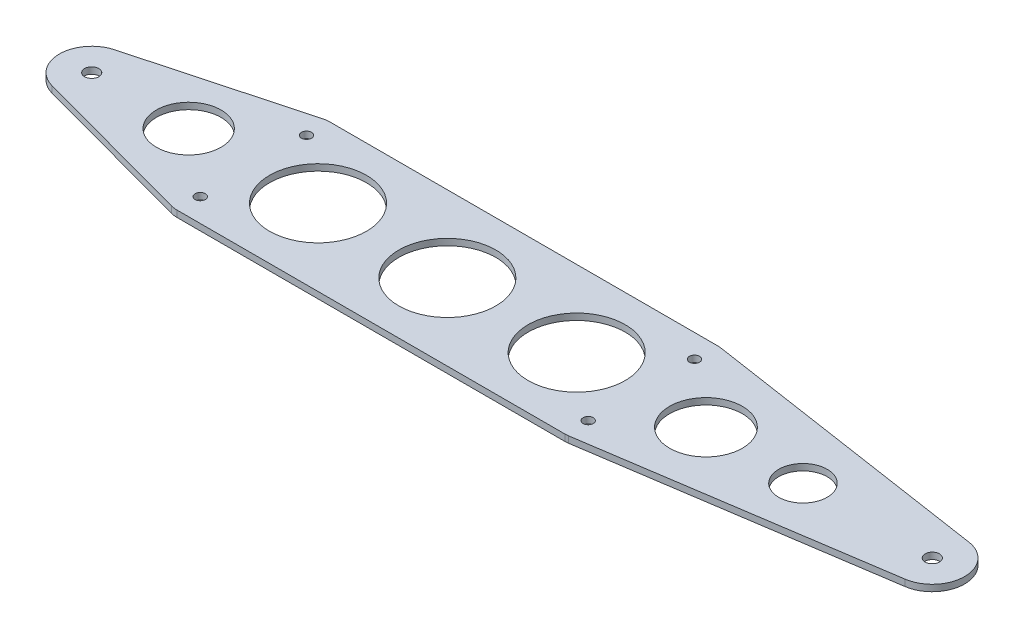
ISO-10303-21;
HEADER;
FILE_DESCRIPTION(('STEP AP214'),'2;1');
FILE_NAME('part.step','',(''),(''),'','','');
FILE_SCHEMA(('AUTOMOTIVE_DESIGN { 1 0 10303 214 1 1 1 1 }'));
ENDSEC;
DATA;
#1=APPLICATION_CONTEXT('core data for automotive mechanical design processes');
#2=APPLICATION_PROTOCOL_DEFINITION('international standard','automotive_design',2000,#1);
#3=PRODUCT_CONTEXT('',#1,'mechanical');
#4=PRODUCT('Part','Part','',(#3));
#5=PRODUCT_RELATED_PRODUCT_CATEGORY('part','',(#4));
#6=PRODUCT_DEFINITION_FORMATION('','',#4);
#7=PRODUCT_DEFINITION_CONTEXT('part definition',#1,'design');
#8=PRODUCT_DEFINITION('design','',#6,#7);
#9=PRODUCT_DEFINITION_SHAPE('','',#8);
#10=(LENGTH_UNIT() NAMED_UNIT(*) SI_UNIT(.MILLI.,.METRE.));
#11=(NAMED_UNIT(*) PLANE_ANGLE_UNIT() SI_UNIT($,.RADIAN.));
#12=(NAMED_UNIT(*) SI_UNIT($,.STERADIAN.) SOLID_ANGLE_UNIT());
#13=UNCERTAINTY_MEASURE_WITH_UNIT(LENGTH_MEASURE(1.E-05),#10,'distance_accuracy_value','');
#14=(GEOMETRIC_REPRESENTATION_CONTEXT(3) GLOBAL_UNCERTAINTY_ASSIGNED_CONTEXT((#13)) GLOBAL_UNIT_ASSIGNED_CONTEXT((#10,
#11,#12)) REPRESENTATION_CONTEXT('',''));
#15=CARTESIAN_POINT('',(0.,0.,0.));
#16=DIRECTION('',(0.,0.,1.));
#17=DIRECTION('',(1.,0.,0.));
#18=AXIS2_PLACEMENT_3D('',#15,#16,#17);
#19=CARTESIAN_POINT('',(-177.8,-2.54,-30.));
#20=DIRECTION('',(0.,0.,-1.));
#21=DIRECTION('',(-1.,0.,0.));
#22=AXIS2_PLACEMENT_3D('',#19,#20,#21);
#23=PLANE('',#22);
#24=DIRECTION('',(-1.,0.,0.));
#25=VECTOR('',#24,1.);
#26=CARTESIAN_POINT('',(-177.8,-2.54,-30.));
#27=LINE('',#26,#25);
#28=CARTESIAN_POINT('',(50.8,-2.54,-30.));
#29=VERTEX_POINT('',#28);
#30=CARTESIAN_POINT('',(-101.6,-2.54,-30.));
#31=VERTEX_POINT('',#30);
#32=EDGE_CURVE('E162',#29,#31,#27,.T.);
#33=ORIENTED_EDGE('',*,*,#32,.T.);
#34=DIRECTION('',(0.,1.,0.));
#35=VECTOR('',#34,1.);
#36=CARTESIAN_POINT('',(-101.6,-2.54,-30.));
#37=LINE('',#36,#35);
#38=CARTESIAN_POINT('',(-101.6,0.,-30.));
#39=VERTEX_POINT('',#38);
#40=EDGE_CURVE('E440',#31,#39,#37,.T.);
#41=ORIENTED_EDGE('',*,*,#40,.T.);
#42=DIRECTION('',(-1.,0.,0.));
#43=VECTOR('',#42,1.);
#44=CARTESIAN_POINT('',(-177.8,0.,-30.));
#45=LINE('',#44,#43);
#46=CARTESIAN_POINT('',(50.8,0.,-30.));
#47=VERTEX_POINT('',#46);
#48=EDGE_CURVE('E163',#47,#39,#45,.T.);
#49=ORIENTED_EDGE('',*,*,#48,.F.);
#50=DIRECTION('',(0.,1.,0.));
#51=VECTOR('',#50,1.);
#52=CARTESIAN_POINT('',(50.8,-2.54,-30.));
#53=LINE('',#52,#51);
#54=EDGE_CURVE('E443',#29,#47,#53,.T.);
#55=ORIENTED_EDGE('',*,*,#54,.F.);
#56=EDGE_LOOP('',(#33,#41,#49,#55));
#57=FACE_BOUND('',#56,.T.);
#58=ADVANCED_FACE('F44',(#57),#23,.T.);
#59=CARTESIAN_POINT('',(-177.8,-2.54,30.));
#60=DIRECTION('',(0.,0.,1.));
#61=DIRECTION('',(1.,0.,0.));
#62=AXIS2_PLACEMENT_3D('',#59,#60,#61);
#63=PLANE('',#62);
#64=DIRECTION('',(0.,1.,0.));
#65=VECTOR('',#64,1.);
#66=CARTESIAN_POINT('',(-101.6,-2.54,30.));
#67=LINE('',#66,#65);
#68=CARTESIAN_POINT('',(-101.6,-2.54,30.));
#69=VERTEX_POINT('',#68);
#70=CARTESIAN_POINT('',(-101.6,0.,30.));
#71=VERTEX_POINT('',#70);
#72=EDGE_CURVE('E138',#69,#71,#67,.T.);
#73=ORIENTED_EDGE('',*,*,#72,.F.);
#74=DIRECTION('',(1.,0.,0.));
#75=VECTOR('',#74,1.);
#76=CARTESIAN_POINT('',(-177.8,-2.54,30.));
#77=LINE('',#76,#75);
#78=CARTESIAN_POINT('',(50.8,-2.54,30.));
#79=VERTEX_POINT('',#78);
#80=EDGE_CURVE('E152',#69,#79,#77,.T.);
#81=ORIENTED_EDGE('',*,*,#80,.T.);
#82=DIRECTION('',(0.,1.,0.));
#83=VECTOR('',#82,1.);
#84=CARTESIAN_POINT('',(50.8,-2.54,30.));
#85=LINE('',#84,#83);
#86=CARTESIAN_POINT('',(50.8,0.,30.));
#87=VERTEX_POINT('',#86);
#88=EDGE_CURVE('E155',#79,#87,#85,.T.);
#89=ORIENTED_EDGE('',*,*,#88,.T.);
#90=DIRECTION('',(1.,0.,0.));
#91=VECTOR('',#90,1.);
#92=CARTESIAN_POINT('',(-177.8,0.,30.));
#93=LINE('',#92,#91);
#94=EDGE_CURVE('E154',#71,#87,#93,.T.);
#95=ORIENTED_EDGE('',*,*,#94,.F.);
#96=EDGE_LOOP('',(#73,#81,#89,#95));
#97=FACE_BOUND('',#96,.T.);
#98=ADVANCED_FACE('F46',(#97),#63,.T.);
#99=CARTESIAN_POINT('',(0.,-2.54,0.));
#100=DIRECTION('',(0.,1.,0.));
#101=DIRECTION('',(0.,0.,1.));
#102=AXIS2_PLACEMENT_3D('',#99,#100,#101);
#103=PLANE('',#102);
#104=CARTESIAN_POINT('',(-127.,-2.54,0.));
#105=DIRECTION('',(0.,1.,0.));
#106=DIRECTION('',(0.,0.,1.));
#107=AXIS2_PLACEMENT_3D('',#104,#105,#106);
#108=CIRCLE('',#107,12.7);
#109=CARTESIAN_POINT('',(-127.,-2.54,12.7));
#110=VERTEX_POINT('',#109);
#111=EDGE_CURVE('E263',#110,#110,#108,.T.);
#112=ORIENTED_EDGE('',*,*,#111,.T.);
#113=EDGE_LOOP('',(#112));
#114=FACE_BOUND('',#113,.T.);
#115=CARTESIAN_POINT('',(76.2,-2.54,0.));
#116=DIRECTION('',(0.,1.,0.));
#117=DIRECTION('',(0.,0.,1.));
#118=AXIS2_PLACEMENT_3D('',#115,#116,#117);
#119=CIRCLE('',#118,14.2875);
#120=CARTESIAN_POINT('',(76.2,-2.54,14.2875));
#121=VERTEX_POINT('',#120);
#122=EDGE_CURVE('E267',#121,#121,#119,.T.);
#123=ORIENTED_EDGE('',*,*,#122,.T.);
#124=EDGE_LOOP('',(#123));
#125=FACE_BOUND('',#124,.T.);
#126=CARTESIAN_POINT('',(114.3,-2.54,0.));
#127=DIRECTION('',(0.,1.,0.));
#128=DIRECTION('',(0.,0.,1.));
#129=AXIS2_PLACEMENT_3D('',#126,#127,#128);
#130=CIRCLE('',#129,9.52500000000001);
#131=CARTESIAN_POINT('',(114.3,-2.54,9.52500000000001));
#132=VERTEX_POINT('',#131);
#133=EDGE_CURVE('E271',#132,#132,#130,.T.);
#134=ORIENTED_EDGE('',*,*,#133,.T.);
#135=EDGE_LOOP('',(#134));
#136=FACE_BOUND('',#135,.T.);
#137=CARTESIAN_POINT('',(25.4,-2.54,0.));
#138=DIRECTION('',(0.,1.,0.));
#139=DIRECTION('',(0.,0.,1.));
#140=AXIS2_PLACEMENT_3D('',#137,#138,#139);
#141=CIRCLE('',#140,19.05);
#142=CARTESIAN_POINT('',(25.4,-2.54,19.05));
#143=VERTEX_POINT('',#142);
#144=EDGE_CURVE('E275',#143,#143,#141,.T.);
#145=ORIENTED_EDGE('',*,*,#144,.T.);
#146=EDGE_LOOP('',(#145));
#147=FACE_BOUND('',#146,.T.);
#148=CARTESIAN_POINT('',(-76.2,-2.54,0.));
#149=DIRECTION('',(0.,1.,0.));
#150=DIRECTION('',(0.,0.,1.));
#151=AXIS2_PLACEMENT_3D('',#148,#149,#150);
#152=CIRCLE('',#151,19.05);
#153=CARTESIAN_POINT('',(-76.2,-2.54,19.05));
#154=VERTEX_POINT('',#153);
#155=EDGE_CURVE('E279',#154,#154,#152,.T.);
#156=ORIENTED_EDGE('',*,*,#155,.T.);
#157=EDGE_LOOP('',(#156));
#158=FACE_BOUND('',#157,.T.);
#159=CARTESIAN_POINT('',(-25.4,-2.54,0.));
#160=DIRECTION('',(0.,1.,0.));
#161=DIRECTION('',(0.,0.,1.));
#162=AXIS2_PLACEMENT_3D('',#159,#160,#161);
#163=CIRCLE('',#162,19.05);
#164=CARTESIAN_POINT('',(-25.4,-2.54,19.05));
#165=VERTEX_POINT('',#164);
#166=EDGE_CURVE('E283',#165,#165,#163,.T.);
#167=ORIENTED_EDGE('',*,*,#166,.T.);
#168=EDGE_LOOP('',(#167));
#169=FACE_BOUND('',#168,.T.);
#170=CARTESIAN_POINT('',(-101.6,-2.54,20.875));
#171=DIRECTION('',(0.,1.,0.));
#172=DIRECTION('',(0.,0.,1.));
#173=AXIS2_PLACEMENT_3D('',#170,#171,#172);
#174=CIRCLE('',#173,2.);
#175=CARTESIAN_POINT('',(-101.6,-2.54,22.875));
#176=VERTEX_POINT('',#175);
#177=EDGE_CURVE('E213',#176,#176,#174,.T.);
#178=ORIENTED_EDGE('',*,*,#177,.T.);
#179=EDGE_LOOP('',(#178));
#180=FACE_BOUND('',#179,.T.);
#181=CARTESIAN_POINT('',(50.8,-2.54,-20.875));
#182=DIRECTION('',(0.,1.,0.));
#183=DIRECTION('',(0.,0.,1.));
#184=AXIS2_PLACEMENT_3D('',#181,#182,#183);
#185=CIRCLE('',#184,2.);
#186=CARTESIAN_POINT('',(50.8,-2.54,-18.875));
#187=VERTEX_POINT('',#186);
#188=EDGE_CURVE('E220',#187,#187,#185,.T.);
#189=ORIENTED_EDGE('',*,*,#188,.T.);
#190=EDGE_LOOP('',(#189));
#191=FACE_BOUND('',#190,.T.);
#192=CARTESIAN_POINT('',(50.8,-2.54,20.875));
#193=DIRECTION('',(0.,1.,0.));
#194=DIRECTION('',(0.,0.,1.));
#195=AXIS2_PLACEMENT_3D('',#192,#193,#194);
#196=CIRCLE('',#195,2.);
#197=CARTESIAN_POINT('',(50.8,-2.54,22.875));
#198=VERTEX_POINT('',#197);
#199=EDGE_CURVE('E206',#198,#198,#196,.T.);
#200=ORIENTED_EDGE('',*,*,#199,.T.);
#201=EDGE_LOOP('',(#200));
#202=FACE_BOUND('',#201,.T.);
#203=CARTESIAN_POINT('',(-101.6,-2.54,-20.875));
#204=DIRECTION('',(0.,1.,0.));
#205=DIRECTION('',(0.,0.,1.));
#206=AXIS2_PLACEMENT_3D('',#203,#204,#205);
#207=CIRCLE('',#206,2.);
#208=CARTESIAN_POINT('',(-101.6,-2.54,-18.875));
#209=VERTEX_POINT('',#208);
#210=EDGE_CURVE('E225',#209,#209,#207,.T.);
#211=ORIENTED_EDGE('',*,*,#210,.T.);
#212=EDGE_LOOP('',(#211));
#213=FACE_BOUND('',#212,.T.);
#214=CARTESIAN_POINT('',(-165.1,-2.54,0.));
#215=DIRECTION('',(0.,1.,0.));
#216=DIRECTION('',(0.,0.,1.));
#217=AXIS2_PLACEMENT_3D('',#214,#215,#216);
#218=CIRCLE('',#217,2.80000000000001);
#219=CARTESIAN_POINT('',(-165.1,-2.54,2.80000000000001));
#220=VERTEX_POINT('',#219);
#221=EDGE_CURVE('E178',#220,#220,#218,.T.);
#222=ORIENTED_EDGE('',*,*,#221,.T.);
#223=EDGE_LOOP('',(#222));
#224=FACE_BOUND('',#223,.T.);
#225=CARTESIAN_POINT('',(165.1,-2.54,0.));
#226=DIRECTION('',(0.,1.,0.));
#227=DIRECTION('',(0.,0.,1.));
#228=AXIS2_PLACEMENT_3D('',#225,#226,#227);
#229=CIRCLE('',#228,2.80000000000001);
#230=CARTESIAN_POINT('',(165.1,-2.54,2.80000000000001));
#231=VERTEX_POINT('',#230);
#232=EDGE_CURVE('E170',#231,#231,#229,.T.);
#233=ORIENTED_EDGE('',*,*,#232,.T.);
#234=EDGE_LOOP('',(#233));
#235=FACE_BOUND('',#234,.T.);
#236=CARTESIAN_POINT('',(-101.6,-2.54,20.875));
#237=DIRECTION('',(0.,1.,0.));
#238=DIRECTION('',(0.,0.,1.));
#239=AXIS2_PLACEMENT_3D('',#236,#237,#238);
#240=CIRCLE('',#239,9.12500000000001);
#241=CARTESIAN_POINT('',(-103.982013976738,-2.54,29.6836113783403));
#242=VERTEX_POINT('',#241);
#243=EDGE_CURVE('E134',#242,#69,#240,.T.);
#244=ORIENTED_EDGE('',*,*,#243,.F.);
#245=DIRECTION('',(0.965327274338659,0.,0.261042627587709));
#246=VECTOR('',#245,1.);
#247=CARTESIAN_POINT('',(-168.415241370364,-2.54,12.259656384101));
#248=LINE('',#247,#246);
#249=CARTESIAN_POINT('',(-168.415241370364,-2.54,12.259656384101));
#250=VERTEX_POINT('',#249);
#251=EDGE_CURVE('E156',#250,#242,#248,.T.);
#252=ORIENTED_EDGE('',*,*,#251,.F.);
#253=CARTESIAN_POINT('',(-165.1,-2.54,0.));
#254=DIRECTION('',(0.,1.,0.));
#255=DIRECTION('',(0.,0.,1.));
#256=AXIS2_PLACEMENT_3D('',#253,#254,#255);
#257=CIRCLE('',#256,12.7);
#258=CARTESIAN_POINT('',(-168.415240859482,-2.54,-12.2596565222531));
#259=VERTEX_POINT('',#258);
#260=EDGE_CURVE('E418',#259,#250,#257,.T.);
#261=ORIENTED_EDGE('',*,*,#260,.F.);
#262=DIRECTION('',(-0.965327274338659,0.,0.261042627587709));
#263=VECTOR('',#262,1.);
#264=CARTESIAN_POINT('',(-168.415240859482,-2.54,-12.2596565222531));
#265=LINE('',#264,#263);
#266=CARTESIAN_POINT('',(-103.982013976738,-2.54,-29.6836113783403));
#267=VERTEX_POINT('',#266);
#268=EDGE_CURVE('E415',#267,#259,#265,.T.);
#269=ORIENTED_EDGE('',*,*,#268,.F.);
#270=CARTESIAN_POINT('',(-101.6,-2.54,-20.875));
#271=DIRECTION('',(0.,1.,0.));
#272=DIRECTION('',(0.,0.,1.));
#273=AXIS2_PLACEMENT_3D('',#270,#271,#272);
#274=CIRCLE('',#273,9.12500000000001);
#275=EDGE_CURVE('E412',#31,#267,#274,.T.);
#276=ORIENTED_EDGE('',*,*,#275,.F.);
#277=ORIENTED_EDGE('',*,*,#32,.F.);
#278=CARTESIAN_POINT('',(50.8,-2.54,-20.875));
#279=DIRECTION('',(0.,1.,0.));
#280=DIRECTION('',(0.,0.,1.));
#281=AXIS2_PLACEMENT_3D('',#278,#279,#280);
#282=CIRCLE('',#281,9.12499999999998);
#283=CARTESIAN_POINT('',(52.16244344239,-2.54,-29.8977142737808));
#284=VERTEX_POINT('',#283);
#285=EDGE_CURVE('E410',#284,#29,#282,.T.);
#286=ORIENTED_EDGE('',*,*,#285,.F.);
#287=DIRECTION('',(-0.988790605345846,0.,-0.149308870398902));
#288=VECTOR('',#287,1.);
#289=CARTESIAN_POINT('',(52.16244344239,-2.54,-29.8977142737808));
#290=LINE('',#289,#288);
#291=CARTESIAN_POINT('',(166.996222654066,-2.54,-12.5576406878922));
#292=VERTEX_POINT('',#291);
#293=EDGE_CURVE('E407',#292,#284,#290,.T.);
#294=ORIENTED_EDGE('',*,*,#293,.F.);
#295=CARTESIAN_POINT('',(165.1,-2.54,0.));
#296=DIRECTION('',(0.,1.,0.));
#297=DIRECTION('',(0.,0.,1.));
#298=AXIS2_PLACEMENT_3D('',#295,#296,#297);
#299=CIRCLE('',#298,12.7);
#300=CARTESIAN_POINT('',(166.996222654066,-2.54,12.5576406878922));
#301=VERTEX_POINT('',#300);
#302=EDGE_CURVE('E405',#301,#292,#299,.T.);
#303=ORIENTED_EDGE('',*,*,#302,.F.);
#304=DIRECTION('',(0.988790605345845,0.,-0.149308870398902));
#305=VECTOR('',#304,1.);
#306=CARTESIAN_POINT('',(52.16244344239,-2.54,29.8977142737808));
#307=LINE('',#306,#305);
#308=CARTESIAN_POINT('',(52.16244344239,-2.54,29.8977142737808));
#309=VERTEX_POINT('',#308);
#310=EDGE_CURVE('E197',#309,#301,#307,.T.);
#311=ORIENTED_EDGE('',*,*,#310,.F.);
#312=CARTESIAN_POINT('',(50.8,-2.54,20.875));
#313=DIRECTION('',(0.,1.,0.));
#314=DIRECTION('',(0.,0.,1.));
#315=AXIS2_PLACEMENT_3D('',#312,#313,#314);
#316=CIRCLE('',#315,9.125);
#317=EDGE_CURVE('E145',#79,#309,#316,.T.);
#318=ORIENTED_EDGE('',*,*,#317,.F.);
#319=ORIENTED_EDGE('',*,*,#80,.F.);
#320=EDGE_LOOP('',(#244,#252,#261,#269,#276,#277,#286,#294,#303,#311,#318,#319));
#321=FACE_BOUND('',#320,.T.);
#322=ADVANCED_FACE('F159',(#114,#125,#136,#147,#158,#169,#180,#191,#202,#213,#224,#235,#321),
#103,.F.);
#323=CARTESIAN_POINT('',(0.,0.,0.));
#324=DIRECTION('',(0.,1.,0.));
#325=DIRECTION('',(0.,0.,1.));
#326=AXIS2_PLACEMENT_3D('',#323,#324,#325);
#327=PLANE('',#326);
#328=CARTESIAN_POINT('',(-127.,0.,0.));
#329=DIRECTION('',(0.,1.,0.));
#330=DIRECTION('',(0.,0.,1.));
#331=AXIS2_PLACEMENT_3D('',#328,#329,#330);
#332=CIRCLE('',#331,12.7);
#333=CARTESIAN_POINT('',(-127.,0.,12.7));
#334=VERTEX_POINT('',#333);
#335=EDGE_CURVE('E378',#334,#334,#332,.T.);
#336=ORIENTED_EDGE('',*,*,#335,.F.);
#337=EDGE_LOOP('',(#336));
#338=FACE_BOUND('',#337,.T.);
#339=CARTESIAN_POINT('',(76.2,0.,0.));
#340=DIRECTION('',(0.,1.,0.));
#341=DIRECTION('',(0.,0.,1.));
#342=AXIS2_PLACEMENT_3D('',#339,#340,#341);
#343=CIRCLE('',#342,14.2875);
#344=CARTESIAN_POINT('',(76.2,0.,14.2875));
#345=VERTEX_POINT('',#344);
#346=EDGE_CURVE('E381',#345,#345,#343,.T.);
#347=ORIENTED_EDGE('',*,*,#346,.F.);
#348=EDGE_LOOP('',(#347));
#349=FACE_BOUND('',#348,.T.);
#350=CARTESIAN_POINT('',(114.3,0.,0.));
#351=DIRECTION('',(0.,1.,0.));
#352=DIRECTION('',(0.,0.,1.));
#353=AXIS2_PLACEMENT_3D('',#350,#351,#352);
#354=CIRCLE('',#353,9.52500000000001);
#355=CARTESIAN_POINT('',(114.3,0.,9.52500000000001));
#356=VERTEX_POINT('',#355);
#357=EDGE_CURVE('E387',#356,#356,#354,.T.);
#358=ORIENTED_EDGE('',*,*,#357,.F.);
#359=EDGE_LOOP('',(#358));
#360=FACE_BOUND('',#359,.T.);
#361=CARTESIAN_POINT('',(25.4,0.,0.));
#362=DIRECTION('',(0.,1.,0.));
#363=DIRECTION('',(0.,0.,1.));
#364=AXIS2_PLACEMENT_3D('',#361,#362,#363);
#365=CIRCLE('',#364,19.05);
#366=CARTESIAN_POINT('',(25.4,0.,19.05));
#367=VERTEX_POINT('',#366);
#368=EDGE_CURVE('E391',#367,#367,#365,.T.);
#369=ORIENTED_EDGE('',*,*,#368,.F.);
#370=EDGE_LOOP('',(#369));
#371=FACE_BOUND('',#370,.T.);
#372=CARTESIAN_POINT('',(-76.2,0.,0.));
#373=DIRECTION('',(0.,1.,0.));
#374=DIRECTION('',(0.,0.,1.));
#375=AXIS2_PLACEMENT_3D('',#372,#373,#374);
#376=CIRCLE('',#375,19.05);
#377=CARTESIAN_POINT('',(-76.2,0.,19.05));
#378=VERTEX_POINT('',#377);
#379=EDGE_CURVE('E392',#378,#378,#376,.T.);
#380=ORIENTED_EDGE('',*,*,#379,.F.);
#381=EDGE_LOOP('',(#380));
#382=FACE_BOUND('',#381,.T.);
#383=CARTESIAN_POINT('',(-25.4,0.,0.));
#384=DIRECTION('',(0.,1.,0.));
#385=DIRECTION('',(0.,0.,1.));
#386=AXIS2_PLACEMENT_3D('',#383,#384,#385);
#387=CIRCLE('',#386,19.05);
#388=CARTESIAN_POINT('',(-25.4,0.,19.05));
#389=VERTEX_POINT('',#388);
#390=EDGE_CURVE('E395',#389,#389,#387,.T.);
#391=ORIENTED_EDGE('',*,*,#390,.F.);
#392=EDGE_LOOP('',(#391));
#393=FACE_BOUND('',#392,.T.);
#394=CARTESIAN_POINT('',(-101.6,0.,20.875));
#395=DIRECTION('',(0.,1.,0.));
#396=DIRECTION('',(0.,0.,1.));
#397=AXIS2_PLACEMENT_3D('',#394,#395,#396);
#398=CIRCLE('',#397,2.);
#399=CARTESIAN_POINT('',(-101.6,0.,22.875));
#400=VERTEX_POINT('',#399);
#401=EDGE_CURVE('E217',#400,#400,#398,.T.);
#402=ORIENTED_EDGE('',*,*,#401,.F.);
#403=EDGE_LOOP('',(#402));
#404=FACE_BOUND('',#403,.T.);
#405=CARTESIAN_POINT('',(50.8,0.,-20.875));
#406=DIRECTION('',(0.,1.,0.));
#407=DIRECTION('',(0.,0.,1.));
#408=AXIS2_PLACEMENT_3D('',#405,#406,#407);
#409=CIRCLE('',#408,2.);
#410=CARTESIAN_POINT('',(50.8,0.,-18.875));
#411=VERTEX_POINT('',#410);
#412=EDGE_CURVE('E209',#411,#411,#409,.T.);
#413=ORIENTED_EDGE('',*,*,#412,.F.);
#414=EDGE_LOOP('',(#413));
#415=FACE_BOUND('',#414,.T.);
#416=CARTESIAN_POINT('',(50.8,0.,20.875));
#417=DIRECTION('',(0.,1.,0.));
#418=DIRECTION('',(0.,0.,1.));
#419=AXIS2_PLACEMENT_3D('',#416,#417,#418);
#420=CIRCLE('',#419,2.);
#421=CARTESIAN_POINT('',(50.8,0.,22.875));
#422=VERTEX_POINT('',#421);
#423=EDGE_CURVE('E210',#422,#422,#420,.T.);
#424=ORIENTED_EDGE('',*,*,#423,.F.);
#425=EDGE_LOOP('',(#424));
#426=FACE_BOUND('',#425,.T.);
#427=CARTESIAN_POINT('',(-101.6,0.,-20.875));
#428=DIRECTION('',(0.,1.,0.));
#429=DIRECTION('',(0.,0.,1.));
#430=AXIS2_PLACEMENT_3D('',#427,#428,#429);
#431=CIRCLE('',#430,2.);
#432=CARTESIAN_POINT('',(-101.6,0.,-18.875));
#433=VERTEX_POINT('',#432);
#434=EDGE_CURVE('E216',#433,#433,#431,.T.);
#435=ORIENTED_EDGE('',*,*,#434,.F.);
#436=EDGE_LOOP('',(#435));
#437=FACE_BOUND('',#436,.T.);
#438=CARTESIAN_POINT('',(-165.1,0.,0.));
#439=DIRECTION('',(0.,1.,0.));
#440=DIRECTION('',(0.,0.,1.));
#441=AXIS2_PLACEMENT_3D('',#438,#439,#440);
#442=CIRCLE('',#441,2.80000000000001);
#443=CARTESIAN_POINT('',(-165.1,0.,2.80000000000001));
#444=VERTEX_POINT('',#443);
#445=EDGE_CURVE('E173',#444,#444,#442,.T.);
#446=ORIENTED_EDGE('',*,*,#445,.F.);
#447=EDGE_LOOP('',(#446));
#448=FACE_BOUND('',#447,.T.);
#449=CARTESIAN_POINT('',(165.1,0.,0.));
#450=DIRECTION('',(0.,1.,0.));
#451=DIRECTION('',(0.,0.,1.));
#452=AXIS2_PLACEMENT_3D('',#449,#450,#451);
#453=CIRCLE('',#452,2.80000000000001);
#454=CARTESIAN_POINT('',(165.1,0.,2.80000000000001));
#455=VERTEX_POINT('',#454);
#456=EDGE_CURVE('E175',#455,#455,#453,.T.);
#457=ORIENTED_EDGE('',*,*,#456,.F.);
#458=EDGE_LOOP('',(#457));
#459=FACE_BOUND('',#458,.T.);
#460=DIRECTION('',(0.965327274338659,0.,0.261042627587709));
#461=VECTOR('',#460,1.);
#462=CARTESIAN_POINT('',(-168.415241370364,0.,12.259656384101));
#463=LINE('',#462,#461);
#464=CARTESIAN_POINT('',(-168.415241370364,0.,12.259656384101));
#465=VERTEX_POINT('',#464);
#466=CARTESIAN_POINT('',(-103.982013976738,0.,29.6836113783403));
#467=VERTEX_POINT('',#466);
#468=EDGE_CURVE('E146',#465,#467,#463,.T.);
#469=ORIENTED_EDGE('',*,*,#468,.T.);
#470=CARTESIAN_POINT('',(-101.6,0.,20.875));
#471=DIRECTION('',(0.,1.,0.));
#472=DIRECTION('',(0.,0.,1.));
#473=AXIS2_PLACEMENT_3D('',#470,#471,#472);
#474=CIRCLE('',#473,9.12500000000001);
#475=EDGE_CURVE('E400',#467,#71,#474,.T.);
#476=ORIENTED_EDGE('',*,*,#475,.T.);
#477=ORIENTED_EDGE('',*,*,#94,.T.);
#478=CARTESIAN_POINT('',(50.8,0.,20.875));
#479=DIRECTION('',(0.,1.,0.));
#480=DIRECTION('',(0.,0.,1.));
#481=AXIS2_PLACEMENT_3D('',#478,#479,#480);
#482=CIRCLE('',#481,9.125);
#483=CARTESIAN_POINT('',(52.16244344239,0.,29.8977142737808));
#484=VERTEX_POINT('',#483);
#485=EDGE_CURVE('E422',#87,#484,#482,.T.);
#486=ORIENTED_EDGE('',*,*,#485,.T.);
#487=DIRECTION('',(0.988790605345845,0.,-0.149308870398902));
#488=VECTOR('',#487,1.);
#489=CARTESIAN_POINT('',(52.16244344239,0.,29.8977142737808));
#490=LINE('',#489,#488);
#491=CARTESIAN_POINT('',(166.996222654066,0.,12.5576406878922));
#492=VERTEX_POINT('',#491);
#493=EDGE_CURVE('E67',#484,#492,#490,.T.);
#494=ORIENTED_EDGE('',*,*,#493,.T.);
#495=CARTESIAN_POINT('',(165.1,0.,0.));
#496=DIRECTION('',(0.,1.,0.));
#497=DIRECTION('',(0.,0.,1.));
#498=AXIS2_PLACEMENT_3D('',#495,#496,#497);
#499=CIRCLE('',#498,12.7);
#500=CARTESIAN_POINT('',(166.996222654066,0.,-12.5576406878922));
#501=VERTEX_POINT('',#500);
#502=EDGE_CURVE('E52',#492,#501,#499,.T.);
#503=ORIENTED_EDGE('',*,*,#502,.T.);
#504=DIRECTION('',(-0.988790605345846,0.,-0.149308870398902));
#505=VECTOR('',#504,1.);
#506=CARTESIAN_POINT('',(52.16244344239,0.,-29.8977142737808));
#507=LINE('',#506,#505);
#508=CARTESIAN_POINT('',(52.16244344239,0.,-29.8977142737808));
#509=VERTEX_POINT('',#508);
#510=EDGE_CURVE('E187',#501,#509,#507,.T.);
#511=ORIENTED_EDGE('',*,*,#510,.T.);
#512=CARTESIAN_POINT('',(50.8,0.,-20.875));
#513=DIRECTION('',(0.,1.,0.));
#514=DIRECTION('',(0.,0.,1.));
#515=AXIS2_PLACEMENT_3D('',#512,#513,#514);
#516=CIRCLE('',#515,9.12499999999998);
#517=EDGE_CURVE('E426',#509,#47,#516,.T.);
#518=ORIENTED_EDGE('',*,*,#517,.T.);
#519=ORIENTED_EDGE('',*,*,#48,.T.);
#520=CARTESIAN_POINT('',(-101.6,0.,-20.875));
#521=DIRECTION('',(0.,1.,0.));
#522=DIRECTION('',(0.,0.,1.));
#523=AXIS2_PLACEMENT_3D('',#520,#521,#522);
#524=CIRCLE('',#523,9.12500000000001);
#525=CARTESIAN_POINT('',(-103.982013976738,0.,-29.6836113783403));
#526=VERTEX_POINT('',#525);
#527=EDGE_CURVE('E428',#39,#526,#524,.T.);
#528=ORIENTED_EDGE('',*,*,#527,.T.);
#529=DIRECTION('',(-0.965327274338659,0.,0.261042627587709));
#530=VECTOR('',#529,1.);
#531=CARTESIAN_POINT('',(-168.415240859482,0.,-12.2596565222531));
#532=LINE('',#531,#530);
#533=CARTESIAN_POINT('',(-168.415240859482,0.,-12.2596565222531));
#534=VERTEX_POINT('',#533);
#535=EDGE_CURVE('E59',#526,#534,#532,.T.);
#536=ORIENTED_EDGE('',*,*,#535,.T.);
#537=CARTESIAN_POINT('',(-165.1,0.,0.));
#538=DIRECTION('',(0.,1.,0.));
#539=DIRECTION('',(0.,0.,1.));
#540=AXIS2_PLACEMENT_3D('',#537,#538,#539);
#541=CIRCLE('',#540,12.7);
#542=EDGE_CURVE('E12',#534,#465,#541,.T.);
#543=ORIENTED_EDGE('',*,*,#542,.T.);
#544=EDGE_LOOP('',(#469,#476,#477,#486,#494,#503,#511,#518,#519,#528,#536,#543));
#545=FACE_BOUND('',#544,.T.);
#546=ADVANCED_FACE('F184',(#338,#349,#360,#371,#382,#393,#404,#415,#426,#437,#448,#459,#545),
#327,.T.);
#547=CARTESIAN_POINT('',(165.1,-2.54,0.));
#548=DIRECTION('',(0.,1.,0.));
#549=DIRECTION('',(0.,0.,1.));
#550=AXIS2_PLACEMENT_3D('',#547,#548,#549);
#551=CYLINDRICAL_SURFACE('',#550,2.80000000000001);
#552=ORIENTED_EDGE('',*,*,#456,.T.);
#553=EDGE_LOOP('',(#552));
#554=FACE_BOUND('',#553,.T.);
#555=ORIENTED_EDGE('',*,*,#232,.F.);
#556=EDGE_LOOP('',(#555));
#557=FACE_BOUND('',#556,.T.);
#558=ADVANCED_FACE('F236',(#554,#557),#551,.F.);
#559=CARTESIAN_POINT('',(-165.1,-2.54,0.));
#560=DIRECTION('',(0.,1.,0.));
#561=DIRECTION('',(0.,0.,1.));
#562=AXIS2_PLACEMENT_3D('',#559,#560,#561);
#563=CYLINDRICAL_SURFACE('',#562,2.80000000000001);
#564=ORIENTED_EDGE('',*,*,#445,.T.);
#565=EDGE_LOOP('',(#564));
#566=FACE_BOUND('',#565,.T.);
#567=ORIENTED_EDGE('',*,*,#221,.F.);
#568=EDGE_LOOP('',(#567));
#569=FACE_BOUND('',#568,.T.);
#570=ADVANCED_FACE('F238',(#566,#569),#563,.F.);
#571=CARTESIAN_POINT('',(-101.6,-2.54,-20.875));
#572=DIRECTION('',(0.,1.,0.));
#573=DIRECTION('',(0.,0.,1.));
#574=AXIS2_PLACEMENT_3D('',#571,#572,#573);
#575=CYLINDRICAL_SURFACE('',#574,2.);
#576=ORIENTED_EDGE('',*,*,#210,.F.);
#577=EDGE_LOOP('',(#576));
#578=FACE_BOUND('',#577,.T.);
#579=ORIENTED_EDGE('',*,*,#434,.T.);
#580=EDGE_LOOP('',(#579));
#581=FACE_BOUND('',#580,.T.);
#582=ADVANCED_FACE('F245',(#578,#581),#575,.F.);
#583=CARTESIAN_POINT('',(50.8,-2.54,20.875));
#584=DIRECTION('',(0.,1.,0.));
#585=DIRECTION('',(0.,0.,1.));
#586=AXIS2_PLACEMENT_3D('',#583,#584,#585);
#587=CYLINDRICAL_SURFACE('',#586,2.);
#588=ORIENTED_EDGE('',*,*,#199,.F.);
#589=EDGE_LOOP('',(#588));
#590=FACE_BOUND('',#589,.T.);
#591=ORIENTED_EDGE('',*,*,#423,.T.);
#592=EDGE_LOOP('',(#591));
#593=FACE_BOUND('',#592,.T.);
#594=ADVANCED_FACE('F294',(#590,#593),#587,.F.);
#595=CARTESIAN_POINT('',(50.8,-2.54,-20.875));
#596=DIRECTION('',(0.,1.,0.));
#597=DIRECTION('',(0.,0.,1.));
#598=AXIS2_PLACEMENT_3D('',#595,#596,#597);
#599=CYLINDRICAL_SURFACE('',#598,2.);
#600=ORIENTED_EDGE('',*,*,#188,.F.);
#601=EDGE_LOOP('',(#600));
#602=FACE_BOUND('',#601,.T.);
#603=ORIENTED_EDGE('',*,*,#412,.T.);
#604=EDGE_LOOP('',(#603));
#605=FACE_BOUND('',#604,.T.);
#606=ADVANCED_FACE('F306',(#602,#605),#599,.F.);
#607=CARTESIAN_POINT('',(-101.6,-2.54,20.875));
#608=DIRECTION('',(0.,1.,0.));
#609=DIRECTION('',(0.,0.,1.));
#610=AXIS2_PLACEMENT_3D('',#607,#608,#609);
#611=CYLINDRICAL_SURFACE('',#610,2.);
#612=ORIENTED_EDGE('',*,*,#177,.F.);
#613=EDGE_LOOP('',(#612));
#614=FACE_BOUND('',#613,.T.);
#615=ORIENTED_EDGE('',*,*,#401,.T.);
#616=EDGE_LOOP('',(#615));
#617=FACE_BOUND('',#616,.T.);
#618=ADVANCED_FACE('F312',(#614,#617),#611,.F.);
#619=CARTESIAN_POINT('',(50.8,-2.54,20.875));
#620=DIRECTION('',(0.,1.,0.));
#621=DIRECTION('',(0.,0.,1.));
#622=AXIS2_PLACEMENT_3D('',#619,#620,#621);
#623=CYLINDRICAL_SURFACE('',#622,9.125);
#624=ORIENTED_EDGE('',*,*,#485,.F.);
#625=ORIENTED_EDGE('',*,*,#88,.F.);
#626=ORIENTED_EDGE('',*,*,#317,.T.);
#627=DIRECTION('',(0.,1.,0.));
#628=VECTOR('',#627,1.);
#629=CARTESIAN_POINT('',(52.16244344239,-2.54,29.8977142737808));
#630=LINE('',#629,#628);
#631=EDGE_CURVE('E198',#309,#484,#630,.T.);
#632=ORIENTED_EDGE('',*,*,#631,.T.);
#633=EDGE_LOOP('',(#624,#625,#626,#632));
#634=FACE_BOUND('',#633,.T.);
#635=ADVANCED_FACE('F315',(#634),#623,.T.);
#636=CARTESIAN_POINT('',(52.16244344239,-2.54,29.8977142737808));
#637=DIRECTION('',(0.149308870398902,0.,0.988790605345846));
#638=DIRECTION('',(0.988790605345846,0.,-0.149308870398902));
#639=AXIS2_PLACEMENT_3D('',#636,#637,#638);
#640=PLANE('',#639);
#641=ORIENTED_EDGE('',*,*,#493,.F.);
#642=ORIENTED_EDGE('',*,*,#631,.F.);
#643=ORIENTED_EDGE('',*,*,#310,.T.);
#644=DIRECTION('',(0.,1.,0.));
#645=VECTOR('',#644,1.);
#646=CARTESIAN_POINT('',(166.996222654066,-2.54,12.5576406878922));
#647=LINE('',#646,#645);
#648=EDGE_CURVE('E192',#301,#492,#647,.T.);
#649=ORIENTED_EDGE('',*,*,#648,.T.);
#650=EDGE_LOOP('',(#641,#642,#643,#649));
#651=FACE_BOUND('',#650,.T.);
#652=ADVANCED_FACE('F196',(#651),#640,.T.);
#653=CARTESIAN_POINT('',(165.1,-2.54,0.));
#654=DIRECTION('',(0.,1.,0.));
#655=DIRECTION('',(0.,0.,1.));
#656=AXIS2_PLACEMENT_3D('',#653,#654,#655);
#657=CYLINDRICAL_SURFACE('',#656,12.7);
#658=ORIENTED_EDGE('',*,*,#648,.F.);
#659=ORIENTED_EDGE('',*,*,#302,.T.);
#660=DIRECTION('',(0.,1.,0.));
#661=VECTOR('',#660,1.);
#662=CARTESIAN_POINT('',(166.996222654066,-2.54,-12.5576406878922));
#663=LINE('',#662,#661);
#664=EDGE_CURVE('E195',#292,#501,#663,.T.);
#665=ORIENTED_EDGE('',*,*,#664,.T.);
#666=ORIENTED_EDGE('',*,*,#502,.F.);
#667=EDGE_LOOP('',(#658,#659,#665,#666));
#668=FACE_BOUND('',#667,.T.);
#669=ADVANCED_FACE('F191',(#668),#657,.T.);
#670=CARTESIAN_POINT('',(52.16244344239,-2.54,-29.8977142737808));
#671=DIRECTION('',(0.149308870398902,0.,-0.988790605345846));
#672=DIRECTION('',(-0.988790605345846,0.,-0.149308870398902));
#673=AXIS2_PLACEMENT_3D('',#670,#671,#672);
#674=PLANE('',#673);
#675=ORIENTED_EDGE('',*,*,#510,.F.);
#676=ORIENTED_EDGE('',*,*,#664,.F.);
#677=ORIENTED_EDGE('',*,*,#293,.T.);
#678=DIRECTION('',(0.,1.,0.));
#679=VECTOR('',#678,1.);
#680=CARTESIAN_POINT('',(52.16244344239,-2.54,-29.8977142737808));
#681=LINE('',#680,#679);
#682=EDGE_CURVE('E200',#284,#509,#681,.T.);
#683=ORIENTED_EDGE('',*,*,#682,.T.);
#684=EDGE_LOOP('',(#675,#676,#677,#683));
#685=FACE_BOUND('',#684,.T.);
#686=ADVANCED_FACE('F329',(#685),#674,.T.);
#687=CARTESIAN_POINT('',(50.8,-2.54,-20.875));
#688=DIRECTION('',(0.,1.,0.));
#689=DIRECTION('',(0.,0.,1.));
#690=AXIS2_PLACEMENT_3D('',#687,#688,#689);
#691=CYLINDRICAL_SURFACE('',#690,9.12499999999998);
#692=ORIENTED_EDGE('',*,*,#517,.F.);
#693=ORIENTED_EDGE('',*,*,#682,.F.);
#694=ORIENTED_EDGE('',*,*,#285,.T.);
#695=ORIENTED_EDGE('',*,*,#54,.T.);
#696=EDGE_LOOP('',(#692,#693,#694,#695));
#697=FACE_BOUND('',#696,.T.);
#698=ADVANCED_FACE('F332',(#697),#691,.T.);
#699=CARTESIAN_POINT('',(-165.1,-2.54,0.));
#700=DIRECTION('',(0.,1.,0.));
#701=DIRECTION('',(0.,0.,1.));
#702=AXIS2_PLACEMENT_3D('',#699,#700,#701);
#703=CYLINDRICAL_SURFACE('',#702,12.7);
#704=ORIENTED_EDGE('',*,*,#260,.T.);
#705=DIRECTION('',(0.,1.,0.));
#706=VECTOR('',#705,1.);
#707=CARTESIAN_POINT('',(-168.415241370364,-2.54,12.259656384101));
#708=LINE('',#707,#706);
#709=EDGE_CURVE('E434',#250,#465,#708,.T.);
#710=ORIENTED_EDGE('',*,*,#709,.T.);
#711=ORIENTED_EDGE('',*,*,#542,.F.);
#712=DIRECTION('',(0.,1.,0.));
#713=VECTOR('',#712,1.);
#714=CARTESIAN_POINT('',(-168.415240859482,-2.54,-12.2596565222531));
#715=LINE('',#714,#713);
#716=EDGE_CURVE('E436',#259,#534,#715,.T.);
#717=ORIENTED_EDGE('',*,*,#716,.F.);
#718=EDGE_LOOP('',(#704,#710,#711,#717));
#719=FACE_BOUND('',#718,.T.);
#720=ADVANCED_FACE('F321',(#719),#703,.T.);
#721=CARTESIAN_POINT('',(-101.6,-2.54,20.875));
#722=DIRECTION('',(0.,1.,0.));
#723=DIRECTION('',(0.,0.,1.));
#724=AXIS2_PLACEMENT_3D('',#721,#722,#723);
#725=CYLINDRICAL_SURFACE('',#724,9.12500000000001);
#726=ORIENTED_EDGE('',*,*,#475,.F.);
#727=DIRECTION('',(0.,1.,0.));
#728=VECTOR('',#727,1.);
#729=CARTESIAN_POINT('',(-103.982013976738,-2.54,29.6836113783403));
#730=LINE('',#729,#728);
#731=EDGE_CURVE('E140',#242,#467,#730,.T.);
#732=ORIENTED_EDGE('',*,*,#731,.F.);
#733=ORIENTED_EDGE('',*,*,#243,.T.);
#734=ORIENTED_EDGE('',*,*,#72,.T.);
#735=EDGE_LOOP('',(#726,#732,#733,#734));
#736=FACE_BOUND('',#735,.T.);
#737=ADVANCED_FACE('F137',(#736),#725,.T.);
#738=CARTESIAN_POINT('',(-168.415241370364,-2.54,12.259656384101));
#739=DIRECTION('',(-0.261042627587709,0.,0.965327274338659));
#740=DIRECTION('',(0.965327274338659,0.,0.261042627587709));
#741=AXIS2_PLACEMENT_3D('',#738,#739,#740);
#742=PLANE('',#741);
#743=ORIENTED_EDGE('',*,*,#468,.F.);
#744=ORIENTED_EDGE('',*,*,#709,.F.);
#745=ORIENTED_EDGE('',*,*,#251,.T.);
#746=ORIENTED_EDGE('',*,*,#731,.T.);
#747=EDGE_LOOP('',(#743,#744,#745,#746));
#748=FACE_BOUND('',#747,.T.);
#749=ADVANCED_FACE('F320',(#748),#742,.T.);
#750=CARTESIAN_POINT('',(-168.415240859482,-2.54,-12.2596565222531));
#751=DIRECTION('',(-0.261042627587709,0.,-0.965327274338659));
#752=DIRECTION('',(-0.965327274338659,0.,0.261042627587709));
#753=AXIS2_PLACEMENT_3D('',#750,#751,#752);
#754=PLANE('',#753);
#755=ORIENTED_EDGE('',*,*,#535,.F.);
#756=DIRECTION('',(0.,1.,0.));
#757=VECTOR('',#756,1.);
#758=CARTESIAN_POINT('',(-103.982013976738,-2.54,-29.6836113783403));
#759=LINE('',#758,#757);
#760=EDGE_CURVE('E438',#267,#526,#759,.T.);
#761=ORIENTED_EDGE('',*,*,#760,.F.);
#762=ORIENTED_EDGE('',*,*,#268,.T.);
#763=ORIENTED_EDGE('',*,*,#716,.T.);
#764=EDGE_LOOP('',(#755,#761,#762,#763));
#765=FACE_BOUND('',#764,.T.);
#766=ADVANCED_FACE('F341',(#765),#754,.T.);
#767=CARTESIAN_POINT('',(-101.6,-2.54,-20.875));
#768=DIRECTION('',(0.,1.,0.));
#769=DIRECTION('',(0.,0.,1.));
#770=AXIS2_PLACEMENT_3D('',#767,#768,#769);
#771=CYLINDRICAL_SURFACE('',#770,9.12500000000001);
#772=ORIENTED_EDGE('',*,*,#527,.F.);
#773=ORIENTED_EDGE('',*,*,#40,.F.);
#774=ORIENTED_EDGE('',*,*,#275,.T.);
#775=ORIENTED_EDGE('',*,*,#760,.T.);
#776=EDGE_LOOP('',(#772,#773,#774,#775));
#777=FACE_BOUND('',#776,.T.);
#778=ADVANCED_FACE('F337',(#777),#771,.T.);
#779=CARTESIAN_POINT('',(-25.4,-2.54,0.));
#780=DIRECTION('',(0.,1.,0.));
#781=DIRECTION('',(0.,0.,1.));
#782=AXIS2_PLACEMENT_3D('',#779,#780,#781);
#783=CYLINDRICAL_SURFACE('',#782,19.05);
#784=ORIENTED_EDGE('',*,*,#166,.F.);
#785=EDGE_LOOP('',(#784));
#786=FACE_BOUND('',#785,.T.);
#787=ORIENTED_EDGE('',*,*,#390,.T.);
#788=EDGE_LOOP('',(#787));
#789=FACE_BOUND('',#788,.T.);
#790=ADVANCED_FACE('F340',(#786,#789),#783,.F.);
#791=CARTESIAN_POINT('',(-76.2,-2.54,0.));
#792=DIRECTION('',(0.,1.,0.));
#793=DIRECTION('',(0.,0.,1.));
#794=AXIS2_PLACEMENT_3D('',#791,#792,#793);
#795=CYLINDRICAL_SURFACE('',#794,19.05);
#796=ORIENTED_EDGE('',*,*,#155,.F.);
#797=EDGE_LOOP('',(#796));
#798=FACE_BOUND('',#797,.T.);
#799=ORIENTED_EDGE('',*,*,#379,.T.);
#800=EDGE_LOOP('',(#799));
#801=FACE_BOUND('',#800,.T.);
#802=ADVANCED_FACE('F353',(#798,#801),#795,.F.);
#803=CARTESIAN_POINT('',(25.4,-2.54,0.));
#804=DIRECTION('',(0.,1.,0.));
#805=DIRECTION('',(0.,0.,1.));
#806=AXIS2_PLACEMENT_3D('',#803,#804,#805);
#807=CYLINDRICAL_SURFACE('',#806,19.05);
#808=ORIENTED_EDGE('',*,*,#144,.F.);
#809=EDGE_LOOP('',(#808));
#810=FACE_BOUND('',#809,.T.);
#811=ORIENTED_EDGE('',*,*,#368,.T.);
#812=EDGE_LOOP('',(#811));
#813=FACE_BOUND('',#812,.T.);
#814=ADVANCED_FACE('F357',(#810,#813),#807,.F.);
#815=CARTESIAN_POINT('',(114.3,-2.54,0.));
#816=DIRECTION('',(0.,1.,0.));
#817=DIRECTION('',(0.,0.,1.));
#818=AXIS2_PLACEMENT_3D('',#815,#816,#817);
#819=CYLINDRICAL_SURFACE('',#818,9.52500000000001);
#820=ORIENTED_EDGE('',*,*,#133,.F.);
#821=EDGE_LOOP('',(#820));
#822=FACE_BOUND('',#821,.T.);
#823=ORIENTED_EDGE('',*,*,#357,.T.);
#824=EDGE_LOOP('',(#823));
#825=FACE_BOUND('',#824,.T.);
#826=ADVANCED_FACE('F361',(#822,#825),#819,.F.);
#827=CARTESIAN_POINT('',(76.2,-2.54,0.));
#828=DIRECTION('',(0.,1.,0.));
#829=DIRECTION('',(0.,0.,1.));
#830=AXIS2_PLACEMENT_3D('',#827,#828,#829);
#831=CYLINDRICAL_SURFACE('',#830,14.2875);
#832=ORIENTED_EDGE('',*,*,#122,.F.);
#833=EDGE_LOOP('',(#832));
#834=FACE_BOUND('',#833,.T.);
#835=ORIENTED_EDGE('',*,*,#346,.T.);
#836=EDGE_LOOP('',(#835));
#837=FACE_BOUND('',#836,.T.);
#838=ADVANCED_FACE('F365',(#834,#837),#831,.F.);
#839=CARTESIAN_POINT('',(-127.,-2.54,0.));
#840=DIRECTION('',(0.,1.,0.));
#841=DIRECTION('',(0.,0.,1.));
#842=AXIS2_PLACEMENT_3D('',#839,#840,#841);
#843=CYLINDRICAL_SURFACE('',#842,12.7);
#844=ORIENTED_EDGE('',*,*,#111,.F.);
#845=EDGE_LOOP('',(#844));
#846=FACE_BOUND('',#845,.T.);
#847=ORIENTED_EDGE('',*,*,#335,.T.);
#848=EDGE_LOOP('',(#847));
#849=FACE_BOUND('',#848,.T.);
#850=ADVANCED_FACE('F369',(#846,#849),#843,.F.);
#851=CLOSED_SHELL('',(#58,#98,#322,#546,#558,#570,#582,#594,#606,#618,#635,#652,#669,#686,#698,
#720,#737,#749,#766,#778,#790,#802,#814,#826,#838,#850));
#852=MANIFOLD_SOLID_BREP('B2',#851);
#853=ADVANCED_BREP_SHAPE_REPRESENTATION('',(#18,#852),#14);
#854=SHAPE_DEFINITION_REPRESENTATION(#9,#853);
ENDSEC;
END-ISO-10303-21;
